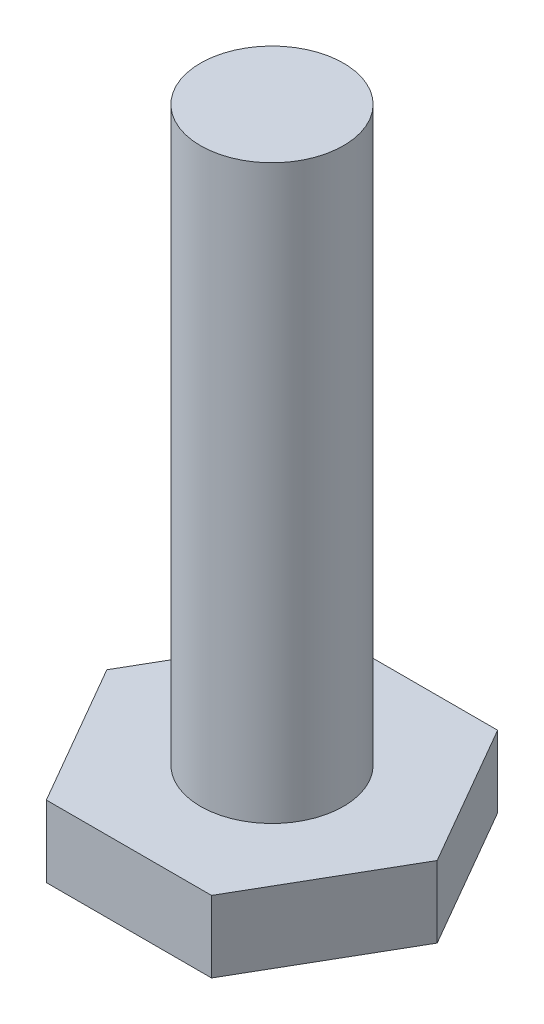
ISO-10303-21;
HEADER;
FILE_DESCRIPTION(('STEP AP214'),'2;1');
FILE_NAME('part.step','',(''),(''),'','','');
FILE_SCHEMA(('AUTOMOTIVE_DESIGN { 1 0 10303 214 1 1 1 1 }'));
ENDSEC;
DATA;
#1=APPLICATION_CONTEXT('core data for automotive mechanical design processes');
#2=APPLICATION_PROTOCOL_DEFINITION('international standard','automotive_design',2000,#1);
#3=PRODUCT_CONTEXT('',#1,'mechanical');
#4=PRODUCT('Part','Part','',(#3));
#5=PRODUCT_RELATED_PRODUCT_CATEGORY('part','',(#4));
#6=PRODUCT_DEFINITION_FORMATION('','',#4);
#7=PRODUCT_DEFINITION_CONTEXT('part definition',#1,'design');
#8=PRODUCT_DEFINITION('design','',#6,#7);
#9=PRODUCT_DEFINITION_SHAPE('','',#8);
#10=(LENGTH_UNIT() NAMED_UNIT(*) SI_UNIT(.MILLI.,.METRE.));
#11=(NAMED_UNIT(*) PLANE_ANGLE_UNIT() SI_UNIT($,.RADIAN.));
#12=(NAMED_UNIT(*) SI_UNIT($,.STERADIAN.) SOLID_ANGLE_UNIT());
#13=UNCERTAINTY_MEASURE_WITH_UNIT(LENGTH_MEASURE(1.E-05),#10,'distance_accuracy_value','');
#14=(GEOMETRIC_REPRESENTATION_CONTEXT(3) GLOBAL_UNCERTAINTY_ASSIGNED_CONTEXT((#13)) GLOBAL_UNIT_ASSIGNED_CONTEXT((#10,
#11,#12)) REPRESENTATION_CONTEXT('',''));
#15=CARTESIAN_POINT('',(0.,0.,0.));
#16=DIRECTION('',(0.,0.,1.));
#17=DIRECTION('',(1.,0.,0.));
#18=AXIS2_PLACEMENT_3D('',#15,#16,#17);
#19=CARTESIAN_POINT('',(7.33234841870825,3.175,0.));
#20=DIRECTION('',(-0.866025403784438,0.,0.5));
#21=DIRECTION('',(0.5,0.,0.866025403784439));
#22=AXIS2_PLACEMENT_3D('',#19,#20,#21);
#23=PLANE('',#22);
#24=DIRECTION('',(-0.5,0.,-0.866025403784438));
#25=VECTOR('',#24,1.);
#26=CARTESIAN_POINT('',(7.33234841870825,0.,0.));
#27=LINE('',#26,#25);
#28=CARTESIAN_POINT('',(7.33234841870825,0.,0.));
#29=VERTEX_POINT('',#28);
#30=CARTESIAN_POINT('',(3.66617420935412,0.,-6.35));
#31=VERTEX_POINT('',#30);
#32=EDGE_CURVE('E119',#29,#31,#27,.T.);
#33=ORIENTED_EDGE('',*,*,#32,.T.);
#34=DIRECTION('',(0.,-1.,0.));
#35=VECTOR('',#34,1.);
#36=CARTESIAN_POINT('',(3.66617420935412,3.175,-6.35));
#37=LINE('',#36,#35);
#38=CARTESIAN_POINT('',(3.66617420935412,3.175,-6.35));
#39=VERTEX_POINT('',#38);
#40=EDGE_CURVE('E36',#39,#31,#37,.T.);
#41=ORIENTED_EDGE('',*,*,#40,.F.);
#42=DIRECTION('',(-0.5,0.,-0.866025403784438));
#43=VECTOR('',#42,1.);
#44=CARTESIAN_POINT('',(7.33234841870825,3.175,0.));
#45=LINE('',#44,#43);
#46=CARTESIAN_POINT('',(7.33234841870825,3.175,0.));
#47=VERTEX_POINT('',#46);
#48=EDGE_CURVE('E130',#47,#39,#45,.T.);
#49=ORIENTED_EDGE('',*,*,#48,.F.);
#50=DIRECTION('',(0.,-1.,0.));
#51=VECTOR('',#50,1.);
#52=CARTESIAN_POINT('',(7.33234841870825,3.175,0.));
#53=LINE('',#52,#51);
#54=EDGE_CURVE('E115',#47,#29,#53,.T.);
#55=ORIENTED_EDGE('',*,*,#54,.T.);
#56=EDGE_LOOP('',(#33,#41,#49,#55));
#57=FACE_BOUND('',#56,.T.);
#58=ADVANCED_FACE('F33',(#57),#23,.F.);
#59=CARTESIAN_POINT('',(3.66617420935412,3.175,-6.35));
#60=DIRECTION('',(0.,0.,1.));
#61=DIRECTION('',(1.,0.,0.));
#62=AXIS2_PLACEMENT_3D('',#59,#60,#61);
#63=PLANE('',#62);
#64=DIRECTION('',(-1.,0.,0.));
#65=VECTOR('',#64,1.);
#66=CARTESIAN_POINT('',(3.66617420935412,0.,-6.35));
#67=LINE('',#66,#65);
#68=CARTESIAN_POINT('',(-3.66617420935412,0.,-6.35));
#69=VERTEX_POINT('',#68);
#70=EDGE_CURVE('E122',#31,#69,#67,.T.);
#71=ORIENTED_EDGE('',*,*,#70,.T.);
#72=DIRECTION('',(0.,-1.,0.));
#73=VECTOR('',#72,1.);
#74=CARTESIAN_POINT('',(-3.66617420935412,3.175,-6.35));
#75=LINE('',#74,#73);
#76=CARTESIAN_POINT('',(-3.66617420935412,3.175,-6.35));
#77=VERTEX_POINT('',#76);
#78=EDGE_CURVE('E133',#77,#69,#75,.T.);
#79=ORIENTED_EDGE('',*,*,#78,.F.);
#80=DIRECTION('',(-1.,0.,0.));
#81=VECTOR('',#80,1.);
#82=CARTESIAN_POINT('',(3.66617420935412,3.175,-6.35));
#83=LINE('',#82,#81);
#84=EDGE_CURVE('E88',#39,#77,#83,.T.);
#85=ORIENTED_EDGE('',*,*,#84,.F.);
#86=ORIENTED_EDGE('',*,*,#40,.T.);
#87=EDGE_LOOP('',(#71,#79,#85,#86));
#88=FACE_BOUND('',#87,.T.);
#89=ADVANCED_FACE('F138',(#88),#63,.F.);
#90=CARTESIAN_POINT('',(-3.66617420935412,3.175,-6.35));
#91=DIRECTION('',(0.866025403784439,0.,0.499999999999999));
#92=DIRECTION('',(0.499999999999999,0.,-0.866025403784439));
#93=AXIS2_PLACEMENT_3D('',#90,#91,#92);
#94=PLANE('',#93);
#95=DIRECTION('',(-0.499999999999999,0.,0.866025403784439));
#96=VECTOR('',#95,1.);
#97=CARTESIAN_POINT('',(-3.66617420935412,0.,-6.35));
#98=LINE('',#97,#96);
#99=CARTESIAN_POINT('',(-7.33234841870824,0.,0.));
#100=VERTEX_POINT('',#99);
#101=EDGE_CURVE('E125',#69,#100,#98,.T.);
#102=ORIENTED_EDGE('',*,*,#101,.T.);
#103=DIRECTION('',(0.,-1.,0.));
#104=VECTOR('',#103,1.);
#105=CARTESIAN_POINT('',(-7.33234841870824,3.175,0.));
#106=LINE('',#105,#104);
#107=CARTESIAN_POINT('',(-7.33234841870824,3.175,0.));
#108=VERTEX_POINT('',#107);
#109=EDGE_CURVE('E110',#108,#100,#106,.T.);
#110=ORIENTED_EDGE('',*,*,#109,.F.);
#111=DIRECTION('',(-0.499999999999999,0.,0.866025403784439));
#112=VECTOR('',#111,1.);
#113=CARTESIAN_POINT('',(-3.66617420935412,3.175,-6.35));
#114=LINE('',#113,#112);
#115=EDGE_CURVE('E101',#77,#108,#114,.T.);
#116=ORIENTED_EDGE('',*,*,#115,.F.);
#117=ORIENTED_EDGE('',*,*,#78,.T.);
#118=EDGE_LOOP('',(#102,#110,#116,#117));
#119=FACE_BOUND('',#118,.T.);
#120=ADVANCED_FACE('F144',(#119),#94,.F.);
#121=CARTESIAN_POINT('',(-7.33234841870824,3.175,0.));
#122=DIRECTION('',(0.866025403784438,0.,-0.5));
#123=DIRECTION('',(-0.5,0.,-0.866025403784439));
#124=AXIS2_PLACEMENT_3D('',#121,#122,#123);
#125=PLANE('',#124);
#126=DIRECTION('',(0.5,0.,0.866025403784438));
#127=VECTOR('',#126,1.);
#128=CARTESIAN_POINT('',(-7.33234841870824,0.,0.));
#129=LINE('',#128,#127);
#130=CARTESIAN_POINT('',(-3.66617420935412,0.,6.35));
#131=VERTEX_POINT('',#130);
#132=EDGE_CURVE('E109',#100,#131,#129,.T.);
#133=ORIENTED_EDGE('',*,*,#132,.T.);
#134=DIRECTION('',(0.,-1.,0.));
#135=VECTOR('',#134,1.);
#136=CARTESIAN_POINT('',(-3.66617420935412,3.175,6.35));
#137=LINE('',#136,#135);
#138=CARTESIAN_POINT('',(-3.66617420935412,3.175,6.35));
#139=VERTEX_POINT('',#138);
#140=EDGE_CURVE('E106',#139,#131,#137,.T.);
#141=ORIENTED_EDGE('',*,*,#140,.F.);
#142=DIRECTION('',(0.5,0.,0.866025403784438));
#143=VECTOR('',#142,1.);
#144=CARTESIAN_POINT('',(-7.33234841870824,3.175,0.));
#145=LINE('',#144,#143);
#146=EDGE_CURVE('E95',#108,#139,#145,.T.);
#147=ORIENTED_EDGE('',*,*,#146,.F.);
#148=ORIENTED_EDGE('',*,*,#109,.T.);
#149=EDGE_LOOP('',(#133,#141,#147,#148));
#150=FACE_BOUND('',#149,.T.);
#151=ADVANCED_FACE('F107',(#150),#125,.F.);
#152=CARTESIAN_POINT('',(-3.66617420935412,3.175,6.35));
#153=DIRECTION('',(0.,0.,-1.));
#154=DIRECTION('',(-1.,0.,0.));
#155=AXIS2_PLACEMENT_3D('',#152,#153,#154);
#156=PLANE('',#155);
#157=DIRECTION('',(1.,0.,0.));
#158=VECTOR('',#157,1.);
#159=CARTESIAN_POINT('',(-3.66617420935412,0.,6.35));
#160=LINE('',#159,#158);
#161=CARTESIAN_POINT('',(3.66617420935412,0.,6.35));
#162=VERTEX_POINT('',#161);
#163=EDGE_CURVE('E73',#131,#162,#160,.T.);
#164=ORIENTED_EDGE('',*,*,#163,.T.);
#165=DIRECTION('',(0.,-1.,0.));
#166=VECTOR('',#165,1.);
#167=CARTESIAN_POINT('',(3.66617420935412,3.175,6.35));
#168=LINE('',#167,#166);
#169=CARTESIAN_POINT('',(3.66617420935412,3.175,6.35));
#170=VERTEX_POINT('',#169);
#171=EDGE_CURVE('E111',#170,#162,#168,.T.);
#172=ORIENTED_EDGE('',*,*,#171,.F.);
#173=DIRECTION('',(1.,0.,0.));
#174=VECTOR('',#173,1.);
#175=CARTESIAN_POINT('',(-3.66617420935412,3.175,6.35));
#176=LINE('',#175,#174);
#177=EDGE_CURVE('E99',#139,#170,#176,.T.);
#178=ORIENTED_EDGE('',*,*,#177,.F.);
#179=ORIENTED_EDGE('',*,*,#140,.T.);
#180=EDGE_LOOP('',(#164,#172,#178,#179));
#181=FACE_BOUND('',#180,.T.);
#182=ADVANCED_FACE('F113',(#181),#156,.F.);
#183=CARTESIAN_POINT('',(3.66617420935412,3.175,6.35));
#184=DIRECTION('',(-0.866025403784439,0.,-0.5));
#185=DIRECTION('',(-0.5,0.,0.866025403784439));
#186=AXIS2_PLACEMENT_3D('',#183,#184,#185);
#187=PLANE('',#186);
#188=DIRECTION('',(0.5,0.,-0.866025403784439));
#189=VECTOR('',#188,1.);
#190=CARTESIAN_POINT('',(3.66617420935412,0.,6.35));
#191=LINE('',#190,#189);
#192=EDGE_CURVE('E79',#162,#29,#191,.T.);
#193=ORIENTED_EDGE('',*,*,#192,.T.);
#194=ORIENTED_EDGE('',*,*,#54,.F.);
#195=DIRECTION('',(0.5,0.,-0.866025403784439));
#196=VECTOR('',#195,1.);
#197=CARTESIAN_POINT('',(3.66617420935412,3.175,6.35));
#198=LINE('',#197,#196);
#199=EDGE_CURVE('E50',#170,#47,#198,.T.);
#200=ORIENTED_EDGE('',*,*,#199,.F.);
#201=ORIENTED_EDGE('',*,*,#171,.T.);
#202=EDGE_LOOP('',(#193,#194,#200,#201));
#203=FACE_BOUND('',#202,.T.);
#204=ADVANCED_FACE('F160',(#203),#187,.F.);
#205=CARTESIAN_POINT('',(0.,3.175,0.));
#206=DIRECTION('',(0.,1.,0.));
#207=DIRECTION('',(0.,0.,1.));
#208=AXIS2_PLACEMENT_3D('',#205,#206,#207);
#209=PLANE('',#208);
#210=CARTESIAN_POINT('',(0.,3.175,0.));
#211=DIRECTION('',(0.,1.,0.));
#212=DIRECTION('',(0.,0.,1.));
#213=AXIS2_PLACEMENT_3D('',#210,#211,#212);
#214=CIRCLE('',#213,3.175);
#215=CARTESIAN_POINT('',(0.,3.175,3.175));
#216=VERTEX_POINT('',#215);
#217=EDGE_CURVE('E11',#216,#216,#214,.T.);
#218=ORIENTED_EDGE('',*,*,#217,.F.);
#219=EDGE_LOOP('',(#218));
#220=FACE_BOUND('',#219,.T.);
#221=ORIENTED_EDGE('',*,*,#48,.T.);
#222=ORIENTED_EDGE('',*,*,#84,.T.);
#223=ORIENTED_EDGE('',*,*,#115,.T.);
#224=ORIENTED_EDGE('',*,*,#146,.T.);
#225=ORIENTED_EDGE('',*,*,#177,.T.);
#226=ORIENTED_EDGE('',*,*,#199,.T.);
#227=EDGE_LOOP('',(#221,#222,#223,#224,#225,#226));
#228=FACE_BOUND('',#227,.T.);
#229=ADVANCED_FACE('F97',(#220,#228),#209,.T.);
#230=CARTESIAN_POINT('',(0.,0.,0.));
#231=DIRECTION('',(0.,1.,0.));
#232=DIRECTION('',(0.,0.,1.));
#233=AXIS2_PLACEMENT_3D('',#230,#231,#232);
#234=PLANE('',#233);
#235=ORIENTED_EDGE('',*,*,#32,.F.);
#236=ORIENTED_EDGE('',*,*,#192,.F.);
#237=ORIENTED_EDGE('',*,*,#163,.F.);
#238=ORIENTED_EDGE('',*,*,#132,.F.);
#239=ORIENTED_EDGE('',*,*,#101,.F.);
#240=ORIENTED_EDGE('',*,*,#70,.F.);
#241=EDGE_LOOP('',(#235,#236,#237,#238,#239,#240));
#242=FACE_BOUND('',#241,.T.);
#243=ADVANCED_FACE('F143',(#242),#234,.F.);
#244=CARTESIAN_POINT('',(0.,28.575,0.));
#245=DIRECTION('',(0.,-1.,0.));
#246=DIRECTION('',(0.,0.,-1.));
#247=AXIS2_PLACEMENT_3D('',#244,#245,#246);
#248=CYLINDRICAL_SURFACE('',#247,3.175);
#249=CARTESIAN_POINT('',(0.,28.575,0.));
#250=DIRECTION('',(0.,1.,0.));
#251=DIRECTION('',(0.,0.,1.));
#252=AXIS2_PLACEMENT_3D('',#249,#250,#251);
#253=CIRCLE('',#252,3.175);
#254=CARTESIAN_POINT('',(0.,28.575,3.175));
#255=VERTEX_POINT('',#254);
#256=EDGE_CURVE('E123',#255,#255,#253,.T.);
#257=ORIENTED_EDGE('',*,*,#256,.F.);
#258=EDGE_LOOP('',(#257));
#259=FACE_BOUND('',#258,.T.);
#260=ORIENTED_EDGE('',*,*,#217,.T.);
#261=EDGE_LOOP('',(#260));
#262=FACE_BOUND('',#261,.T.);
#263=ADVANCED_FACE('F153',(#259,#262),#248,.T.);
#264=CARTESIAN_POINT('',(0.,28.575,0.));
#265=DIRECTION('',(0.,1.,0.));
#266=DIRECTION('',(0.,0.,1.));
#267=AXIS2_PLACEMENT_3D('',#264,#265,#266);
#268=PLANE('',#267);
#269=ORIENTED_EDGE('',*,*,#256,.T.);
#270=EDGE_LOOP('',(#269));
#271=FACE_BOUND('',#270,.T.);
#272=ADVANCED_FACE('F151',(#271),#268,.T.);
#273=CLOSED_SHELL('',(#58,#89,#120,#151,#182,#204,#229,#243,#263,#272));
#274=MANIFOLD_SOLID_BREP('B2',#273);
#275=ADVANCED_BREP_SHAPE_REPRESENTATION('',(#18,#274),#14);
#276=SHAPE_DEFINITION_REPRESENTATION(#9,#275);
ENDSEC;
END-ISO-10303-21;
